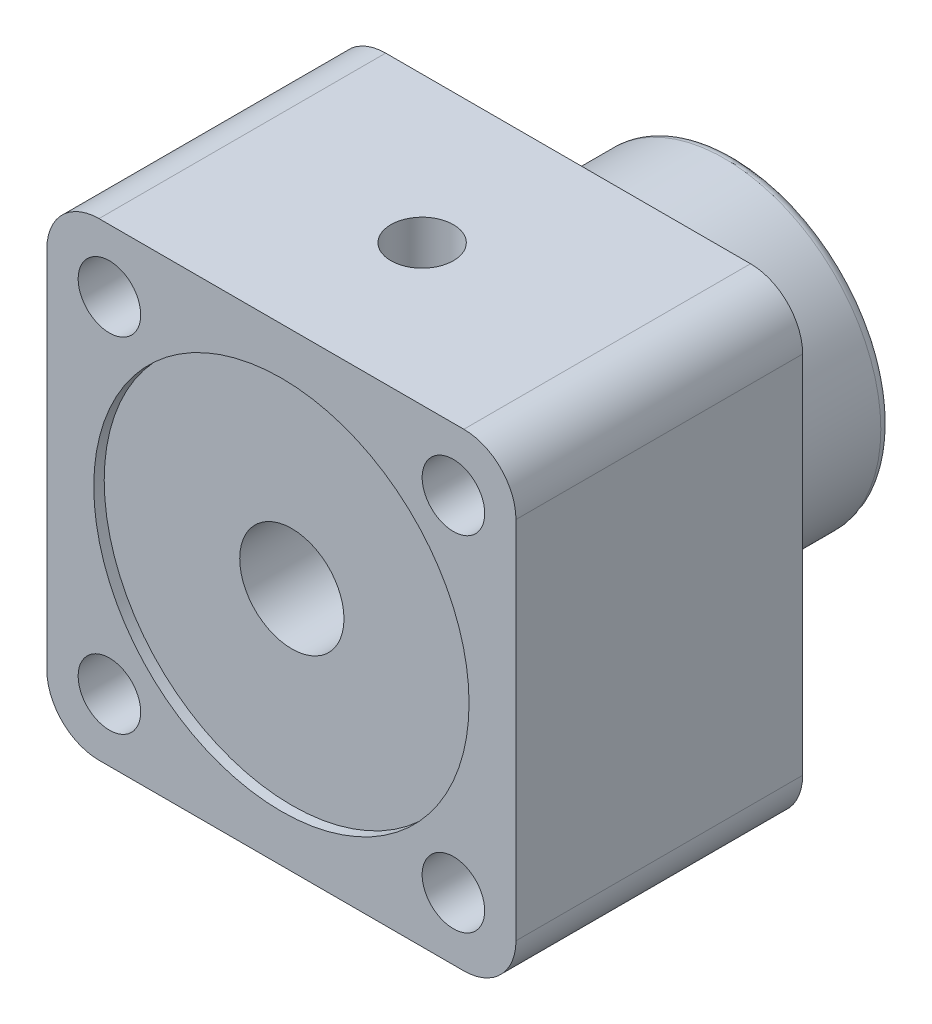
ISO-10303-21;
HEADER;
FILE_DESCRIPTION(('STEP AP214'),'2;1');
FILE_NAME('part.step','',(''),(''),'','','');
FILE_SCHEMA(('AUTOMOTIVE_DESIGN { 1 0 10303 214 1 1 1 1 }'));
ENDSEC;
DATA;
#1=APPLICATION_CONTEXT('core data for automotive mechanical design processes');
#2=APPLICATION_PROTOCOL_DEFINITION('international standard','automotive_design',2000,#1);
#3=PRODUCT_CONTEXT('',#1,'mechanical');
#4=PRODUCT('Part','Part','',(#3));
#5=PRODUCT_RELATED_PRODUCT_CATEGORY('part','',(#4));
#6=PRODUCT_DEFINITION_FORMATION('','',#4);
#7=PRODUCT_DEFINITION_CONTEXT('part definition',#1,'design');
#8=PRODUCT_DEFINITION('design','',#6,#7);
#9=PRODUCT_DEFINITION_SHAPE('','',#8);
#10=(LENGTH_UNIT() NAMED_UNIT(*) SI_UNIT(.MILLI.,.METRE.));
#11=(NAMED_UNIT(*) PLANE_ANGLE_UNIT() SI_UNIT($,.RADIAN.));
#12=(NAMED_UNIT(*) SI_UNIT($,.STERADIAN.) SOLID_ANGLE_UNIT());
#13=UNCERTAINTY_MEASURE_WITH_UNIT(LENGTH_MEASURE(1.E-05),#10,'distance_accuracy_value','');
#14=(GEOMETRIC_REPRESENTATION_CONTEXT(3) GLOBAL_UNCERTAINTY_ASSIGNED_CONTEXT((#13)) GLOBAL_UNIT_ASSIGNED_CONTEXT((#10,
#11,#12)) REPRESENTATION_CONTEXT('',''));
#15=CARTESIAN_POINT('',(0.,0.,0.));
#16=DIRECTION('',(0.,0.,1.));
#17=DIRECTION('',(1.,0.,0.));
#18=AXIS2_PLACEMENT_3D('',#15,#16,#17);
#19=CARTESIAN_POINT('',(-40.,40.,0.));
#20=DIRECTION('',(0.,0.,1.));
#21=DIRECTION('',(1.,0.,0.));
#22=AXIS2_PLACEMENT_3D('',#19,#20,#21);
#23=PLANE('',#22);
#24=CARTESIAN_POINT('',(-39.,39.,0.));
#25=DIRECTION('',(0.,0.,1.));
#26=DIRECTION('',(-1.,0.,0.));
#27=AXIS2_PLACEMENT_3D('',#24,#25,#26);
#28=CIRCLE('',#27,3.);
#29=CARTESIAN_POINT('',(-42.,39.,0.));
#30=VERTEX_POINT('',#29);
#31=EDGE_CURVE('E262',#30,#30,#28,.T.);
#32=ORIENTED_EDGE('',*,*,#31,.T.);
#33=EDGE_LOOP('',(#32));
#34=FACE_BOUND('',#33,.T.);
#35=CARTESIAN_POINT('',(-39.,6.00000000000001,0.));
#36=DIRECTION('',(0.,0.,1.));
#37=DIRECTION('',(-1.,0.,0.));
#38=AXIS2_PLACEMENT_3D('',#35,#36,#37);
#39=CIRCLE('',#38,3.);
#40=CARTESIAN_POINT('',(-42.,6.00000000000001,0.));
#41=VERTEX_POINT('',#40);
#42=EDGE_CURVE('E256',#41,#41,#39,.T.);
#43=ORIENTED_EDGE('',*,*,#42,.T.);
#44=EDGE_LOOP('',(#43));
#45=FACE_BOUND('',#44,.T.);
#46=CARTESIAN_POINT('',(-6.00000000000002,6.00000000000001,0.));
#47=DIRECTION('',(0.,0.,1.));
#48=DIRECTION('',(1.,0.,0.));
#49=AXIS2_PLACEMENT_3D('',#46,#47,#48);
#50=CIRCLE('',#49,3.);
#51=CARTESIAN_POINT('',(-3.00000000000001,6.00000000000001,0.));
#52=VERTEX_POINT('',#51);
#53=EDGE_CURVE('E250',#52,#52,#50,.T.);
#54=ORIENTED_EDGE('',*,*,#53,.T.);
#55=EDGE_LOOP('',(#54));
#56=FACE_BOUND('',#55,.T.);
#57=CARTESIAN_POINT('',(-6.00000000000001,39.,0.));
#58=DIRECTION('',(0.,0.,1.));
#59=DIRECTION('',(1.,0.,0.));
#60=AXIS2_PLACEMENT_3D('',#57,#58,#59);
#61=CIRCLE('',#60,3.);
#62=CARTESIAN_POINT('',(-3.00000000000001,39.,0.));
#63=VERTEX_POINT('',#62);
#64=EDGE_CURVE('E244',#63,#63,#61,.T.);
#65=ORIENTED_EDGE('',*,*,#64,.T.);
#66=EDGE_LOOP('',(#65));
#67=FACE_BOUND('',#66,.T.);
#68=CARTESIAN_POINT('',(-40.,40.,0.));
#69=DIRECTION('',(0.,0.,1.));
#70=DIRECTION('',(1.,0.,0.));
#71=AXIS2_PLACEMENT_3D('',#68,#69,#70);
#72=CIRCLE('',#71,5.);
#73=CARTESIAN_POINT('',(-40.,45.,0.));
#74=VERTEX_POINT('',#73);
#75=CARTESIAN_POINT('',(-45.,40.,0.));
#76=VERTEX_POINT('',#75);
#77=EDGE_CURVE('E131',#74,#76,#72,.T.);
#78=ORIENTED_EDGE('',*,*,#77,.F.);
#79=DIRECTION('',(-1.,0.,0.));
#80=VECTOR('',#79,1.);
#81=CARTESIAN_POINT('',(-5.,45.,0.));
#82=LINE('',#81,#80);
#83=CARTESIAN_POINT('',(-5.,45.,0.));
#84=VERTEX_POINT('',#83);
#85=EDGE_CURVE('E84',#84,#74,#82,.T.);
#86=ORIENTED_EDGE('',*,*,#85,.F.);
#87=CARTESIAN_POINT('',(-5.,40.,0.));
#88=DIRECTION('',(0.,0.,1.));
#89=DIRECTION('',(1.,0.,0.));
#90=AXIS2_PLACEMENT_3D('',#87,#88,#89);
#91=CIRCLE('',#90,5.);
#92=CARTESIAN_POINT('',(0.,40.,0.));
#93=VERTEX_POINT('',#92);
#94=EDGE_CURVE('E78',#93,#84,#91,.T.);
#95=ORIENTED_EDGE('',*,*,#94,.F.);
#96=DIRECTION('',(0.,1.,0.));
#97=VECTOR('',#96,1.);
#98=CARTESIAN_POINT('',(0.,40.,0.));
#99=LINE('',#98,#97);
#100=CARTESIAN_POINT('',(0.,5.,0.));
#101=VERTEX_POINT('',#100);
#102=EDGE_CURVE('E121',#101,#93,#99,.T.);
#103=ORIENTED_EDGE('',*,*,#102,.F.);
#104=CARTESIAN_POINT('',(-4.99999999999999,5.,0.));
#105=DIRECTION('',(0.,0.,1.));
#106=DIRECTION('',(1.,0.,0.));
#107=AXIS2_PLACEMENT_3D('',#104,#105,#106);
#108=CIRCLE('',#107,5.);
#109=CARTESIAN_POINT('',(-4.99999999999999,0.,0.));
#110=VERTEX_POINT('',#109);
#111=EDGE_CURVE('E141',#110,#101,#108,.T.);
#112=ORIENTED_EDGE('',*,*,#111,.F.);
#113=DIRECTION('',(1.,0.,0.));
#114=VECTOR('',#113,1.);
#115=CARTESIAN_POINT('',(-40.,0.,0.));
#116=LINE('',#115,#114);
#117=CARTESIAN_POINT('',(-40.,0.,0.));
#118=VERTEX_POINT('',#117);
#119=EDGE_CURVE('E139',#118,#110,#116,.T.);
#120=ORIENTED_EDGE('',*,*,#119,.F.);
#121=CARTESIAN_POINT('',(-40.,5.,0.));
#122=DIRECTION('',(0.,0.,1.));
#123=DIRECTION('',(1.,0.,0.));
#124=AXIS2_PLACEMENT_3D('',#121,#122,#123);
#125=CIRCLE('',#124,5.);
#126=CARTESIAN_POINT('',(-45.,5.,0.));
#127=VERTEX_POINT('',#126);
#128=EDGE_CURVE('E137',#127,#118,#125,.T.);
#129=ORIENTED_EDGE('',*,*,#128,.F.);
#130=DIRECTION('',(0.,-1.,0.));
#131=VECTOR('',#130,1.);
#132=CARTESIAN_POINT('',(-45.,40.,0.));
#133=LINE('',#132,#131);
#134=EDGE_CURVE('E134',#76,#127,#133,.T.);
#135=ORIENTED_EDGE('',*,*,#134,.F.);
#136=EDGE_LOOP('',(#78,#86,#95,#103,#112,#120,#129,#135));
#137=FACE_BOUND('',#136,.T.);
#138=CARTESIAN_POINT('',(-22.5,22.5,0.));
#139=DIRECTION('',(0.,0.,1.));
#140=DIRECTION('',(1.,0.,0.));
#141=AXIS2_PLACEMENT_3D('',#138,#139,#140);
#142=CIRCLE('',#141,15.);
#143=CARTESIAN_POINT('',(-7.5,22.5,0.));
#144=VERTEX_POINT('',#143);
#145=EDGE_CURVE('E161',#144,#144,#142,.F.);
#146=ORIENTED_EDGE('',*,*,#145,.F.);
#147=EDGE_LOOP('',(#146));
#148=FACE_BOUND('',#147,.T.);
#149=ADVANCED_FACE('F32',(#34,#45,#56,#67,#137,#148),#23,.F.);
#150=CARTESIAN_POINT('',(-40.,40.,27.5));
#151=DIRECTION('',(0.,0.,1.));
#152=DIRECTION('',(1.,0.,0.));
#153=AXIS2_PLACEMENT_3D('',#150,#151,#152);
#154=PLANE('',#153);
#155=CARTESIAN_POINT('',(-22.5,22.5,27.5));
#156=DIRECTION('',(0.,0.,1.));
#157=DIRECTION('',(1.,0.,0.));
#158=AXIS2_PLACEMENT_3D('',#155,#156,#157);
#159=CIRCLE('',#158,18.);
#160=CARTESIAN_POINT('',(-4.50000000000001,22.5,27.5));
#161=VERTEX_POINT('',#160);
#162=EDGE_CURVE('E165',#161,#161,#159,.T.);
#163=ORIENTED_EDGE('',*,*,#162,.F.);
#164=EDGE_LOOP('',(#163));
#165=FACE_BOUND('',#164,.T.);
#166=CARTESIAN_POINT('',(-39.,6.00000000000001,27.5));
#167=DIRECTION('',(0.,0.,1.));
#168=DIRECTION('',(-1.,0.,0.));
#169=AXIS2_PLACEMENT_3D('',#166,#167,#168);
#170=CIRCLE('',#169,3.);
#171=CARTESIAN_POINT('',(-42.,6.00000000000001,27.5));
#172=VERTEX_POINT('',#171);
#173=EDGE_CURVE('E253',#172,#172,#170,.T.);
#174=ORIENTED_EDGE('',*,*,#173,.F.);
#175=EDGE_LOOP('',(#174));
#176=FACE_BOUND('',#175,.T.);
#177=CARTESIAN_POINT('',(-6.00000000000001,39.,27.5));
#178=DIRECTION('',(0.,0.,1.));
#179=DIRECTION('',(1.,0.,0.));
#180=AXIS2_PLACEMENT_3D('',#177,#178,#179);
#181=CIRCLE('',#180,3.);
#182=CARTESIAN_POINT('',(-3.00000000000001,39.,27.5));
#183=VERTEX_POINT('',#182);
#184=EDGE_CURVE('E135',#183,#183,#181,.T.);
#185=ORIENTED_EDGE('',*,*,#184,.F.);
#186=EDGE_LOOP('',(#185));
#187=FACE_BOUND('',#186,.T.);
#188=CARTESIAN_POINT('',(-40.,40.,27.5));
#189=DIRECTION('',(0.,0.,1.));
#190=DIRECTION('',(1.,0.,0.));
#191=AXIS2_PLACEMENT_3D('',#188,#189,#190);
#192=CIRCLE('',#191,5.);
#193=CARTESIAN_POINT('',(-40.,45.,27.5));
#194=VERTEX_POINT('',#193);
#195=CARTESIAN_POINT('',(-45.,40.,27.5));
#196=VERTEX_POINT('',#195);
#197=EDGE_CURVE('E146',#194,#196,#192,.T.);
#198=ORIENTED_EDGE('',*,*,#197,.T.);
#199=DIRECTION('',(0.,-1.,0.));
#200=VECTOR('',#199,1.);
#201=CARTESIAN_POINT('',(-45.,40.,27.5));
#202=LINE('',#201,#200);
#203=CARTESIAN_POINT('',(-45.,5.,27.5));
#204=VERTEX_POINT('',#203);
#205=EDGE_CURVE('E93',#196,#204,#202,.T.);
#206=ORIENTED_EDGE('',*,*,#205,.T.);
#207=CARTESIAN_POINT('',(-40.,5.,27.5));
#208=DIRECTION('',(0.,0.,1.));
#209=DIRECTION('',(1.,0.,0.));
#210=AXIS2_PLACEMENT_3D('',#207,#208,#209);
#211=CIRCLE('',#210,5.);
#212=CARTESIAN_POINT('',(-40.,0.,27.5));
#213=VERTEX_POINT('',#212);
#214=EDGE_CURVE('E236',#204,#213,#211,.T.);
#215=ORIENTED_EDGE('',*,*,#214,.T.);
#216=DIRECTION('',(1.,0.,0.));
#217=VECTOR('',#216,1.);
#218=CARTESIAN_POINT('',(-40.,0.,27.5));
#219=LINE('',#218,#217);
#220=CARTESIAN_POINT('',(-4.99999999999999,0.,27.5));
#221=VERTEX_POINT('',#220);
#222=EDGE_CURVE('E238',#213,#221,#219,.T.);
#223=ORIENTED_EDGE('',*,*,#222,.T.);
#224=CARTESIAN_POINT('',(-4.99999999999999,5.,27.5));
#225=DIRECTION('',(0.,0.,1.));
#226=DIRECTION('',(1.,0.,0.));
#227=AXIS2_PLACEMENT_3D('',#224,#225,#226);
#228=CIRCLE('',#227,5.);
#229=CARTESIAN_POINT('',(0.,5.,27.5));
#230=VERTEX_POINT('',#229);
#231=EDGE_CURVE('E113',#221,#230,#228,.T.);
#232=ORIENTED_EDGE('',*,*,#231,.T.);
#233=DIRECTION('',(0.,1.,0.));
#234=VECTOR('',#233,1.);
#235=CARTESIAN_POINT('',(0.,40.,27.5));
#236=LINE('',#235,#234);
#237=CARTESIAN_POINT('',(0.,40.,27.5));
#238=VERTEX_POINT('',#237);
#239=EDGE_CURVE('E106',#230,#238,#236,.T.);
#240=ORIENTED_EDGE('',*,*,#239,.T.);
#241=CARTESIAN_POINT('',(-5.,40.,27.5));
#242=DIRECTION('',(0.,0.,1.));
#243=DIRECTION('',(1.,0.,0.));
#244=AXIS2_PLACEMENT_3D('',#241,#242,#243);
#245=CIRCLE('',#244,5.);
#246=CARTESIAN_POINT('',(-5.,45.,27.5));
#247=VERTEX_POINT('',#246);
#248=EDGE_CURVE('E111',#238,#247,#245,.T.);
#249=ORIENTED_EDGE('',*,*,#248,.T.);
#250=DIRECTION('',(-1.,0.,0.));
#251=VECTOR('',#250,1.);
#252=CARTESIAN_POINT('',(-5.,45.,27.5));
#253=LINE('',#252,#251);
#254=EDGE_CURVE('E49',#247,#194,#253,.T.);
#255=ORIENTED_EDGE('',*,*,#254,.T.);
#256=EDGE_LOOP('',(#198,#206,#215,#223,#232,#240,#249,#255));
#257=FACE_BOUND('',#256,.T.);
#258=CARTESIAN_POINT('',(-6.00000000000002,6.00000000000001,27.5));
#259=DIRECTION('',(0.,0.,1.));
#260=DIRECTION('',(1.,0.,0.));
#261=AXIS2_PLACEMENT_3D('',#258,#259,#260);
#262=CIRCLE('',#261,3.);
#263=CARTESIAN_POINT('',(-3.00000000000001,6.00000000000001,27.5));
#264=VERTEX_POINT('',#263);
#265=EDGE_CURVE('E247',#264,#264,#262,.T.);
#266=ORIENTED_EDGE('',*,*,#265,.F.);
#267=EDGE_LOOP('',(#266));
#268=FACE_BOUND('',#267,.T.);
#269=CARTESIAN_POINT('',(-39.,39.,27.5));
#270=DIRECTION('',(0.,0.,1.));
#271=DIRECTION('',(-1.,0.,0.));
#272=AXIS2_PLACEMENT_3D('',#269,#270,#271);
#273=CIRCLE('',#272,3.);
#274=CARTESIAN_POINT('',(-42.,39.,27.5));
#275=VERTEX_POINT('',#274);
#276=EDGE_CURVE('E259',#275,#275,#273,.T.);
#277=ORIENTED_EDGE('',*,*,#276,.F.);
#278=EDGE_LOOP('',(#277));
#279=FACE_BOUND('',#278,.T.);
#280=ADVANCED_FACE('F108',(#165,#176,#187,#257,#268,#279),#154,.T.);
#281=CARTESIAN_POINT('',(-40.,40.,27.5));
#282=DIRECTION('',(0.,0.,-1.));
#283=DIRECTION('',(-1.,0.,0.));
#284=AXIS2_PLACEMENT_3D('',#281,#282,#283);
#285=CYLINDRICAL_SURFACE('',#284,5.);
#286=ORIENTED_EDGE('',*,*,#77,.T.);
#287=DIRECTION('',(0.,0.,-1.));
#288=VECTOR('',#287,1.);
#289=CARTESIAN_POINT('',(-45.,40.,27.5));
#290=LINE('',#289,#288);
#291=EDGE_CURVE('E159',#196,#76,#290,.T.);
#292=ORIENTED_EDGE('',*,*,#291,.F.);
#293=ORIENTED_EDGE('',*,*,#197,.F.);
#294=DIRECTION('',(0.,0.,-1.));
#295=VECTOR('',#294,1.);
#296=CARTESIAN_POINT('',(-40.,45.,27.5));
#297=LINE('',#296,#295);
#298=EDGE_CURVE('E127',#194,#74,#297,.T.);
#299=ORIENTED_EDGE('',*,*,#298,.T.);
#300=EDGE_LOOP('',(#286,#292,#293,#299));
#301=FACE_BOUND('',#300,.T.);
#302=ADVANCED_FACE('F193',(#301),#285,.T.);
#303=CARTESIAN_POINT('',(-45.,40.,27.5));
#304=DIRECTION('',(1.,0.,0.));
#305=DIRECTION('',(0.,1.,0.));
#306=AXIS2_PLACEMENT_3D('',#303,#304,#305);
#307=PLANE('',#306);
#308=ORIENTED_EDGE('',*,*,#134,.T.);
#309=DIRECTION('',(0.,0.,-1.));
#310=VECTOR('',#309,1.);
#311=CARTESIAN_POINT('',(-45.,5.,27.5));
#312=LINE('',#311,#310);
#313=EDGE_CURVE('E156',#204,#127,#312,.T.);
#314=ORIENTED_EDGE('',*,*,#313,.F.);
#315=ORIENTED_EDGE('',*,*,#205,.F.);
#316=ORIENTED_EDGE('',*,*,#291,.T.);
#317=EDGE_LOOP('',(#308,#314,#315,#316));
#318=FACE_BOUND('',#317,.T.);
#319=ADVANCED_FACE('F220',(#318),#307,.F.);
#320=CARTESIAN_POINT('',(-40.,5.,27.5));
#321=DIRECTION('',(0.,0.,-1.));
#322=DIRECTION('',(-1.,0.,0.));
#323=AXIS2_PLACEMENT_3D('',#320,#321,#322);
#324=CYLINDRICAL_SURFACE('',#323,5.);
#325=ORIENTED_EDGE('',*,*,#128,.T.);
#326=DIRECTION('',(0.,0.,-1.));
#327=VECTOR('',#326,1.);
#328=CARTESIAN_POINT('',(-40.,0.,27.5));
#329=LINE('',#328,#327);
#330=EDGE_CURVE('E153',#213,#118,#329,.T.);
#331=ORIENTED_EDGE('',*,*,#330,.F.);
#332=ORIENTED_EDGE('',*,*,#214,.F.);
#333=ORIENTED_EDGE('',*,*,#313,.T.);
#334=EDGE_LOOP('',(#325,#331,#332,#333));
#335=FACE_BOUND('',#334,.T.);
#336=ADVANCED_FACE('F216',(#335),#324,.T.);
#337=CARTESIAN_POINT('',(-40.,0.,27.5));
#338=DIRECTION('',(0.,1.,0.));
#339=DIRECTION('',(0.,0.,1.));
#340=AXIS2_PLACEMENT_3D('',#337,#338,#339);
#341=PLANE('',#340);
#342=ORIENTED_EDGE('',*,*,#119,.T.);
#343=DIRECTION('',(0.,0.,-1.));
#344=VECTOR('',#343,1.);
#345=CARTESIAN_POINT('',(-4.99999999999999,0.,27.5));
#346=LINE('',#345,#344);
#347=EDGE_CURVE('E150',#221,#110,#346,.T.);
#348=ORIENTED_EDGE('',*,*,#347,.F.);
#349=ORIENTED_EDGE('',*,*,#222,.F.);
#350=ORIENTED_EDGE('',*,*,#330,.T.);
#351=EDGE_LOOP('',(#342,#348,#349,#350));
#352=FACE_BOUND('',#351,.T.);
#353=ADVANCED_FACE('F212',(#352),#341,.F.);
#354=CARTESIAN_POINT('',(-4.99999999999999,5.,27.5));
#355=DIRECTION('',(0.,0.,-1.));
#356=DIRECTION('',(-1.,0.,0.));
#357=AXIS2_PLACEMENT_3D('',#354,#355,#356);
#358=CYLINDRICAL_SURFACE('',#357,5.);
#359=ORIENTED_EDGE('',*,*,#111,.T.);
#360=DIRECTION('',(0.,0.,-1.));
#361=VECTOR('',#360,1.);
#362=CARTESIAN_POINT('',(0.,5.,27.5));
#363=LINE('',#362,#361);
#364=EDGE_CURVE('E122',#230,#101,#363,.T.);
#365=ORIENTED_EDGE('',*,*,#364,.F.);
#366=ORIENTED_EDGE('',*,*,#231,.F.);
#367=ORIENTED_EDGE('',*,*,#347,.T.);
#368=EDGE_LOOP('',(#359,#365,#366,#367));
#369=FACE_BOUND('',#368,.T.);
#370=ADVANCED_FACE('F209',(#369),#358,.T.);
#371=CARTESIAN_POINT('',(0.,40.,27.5));
#372=DIRECTION('',(-1.,0.,0.));
#373=DIRECTION('',(0.,-1.,0.));
#374=AXIS2_PLACEMENT_3D('',#371,#372,#373);
#375=PLANE('',#374);
#376=ORIENTED_EDGE('',*,*,#102,.T.);
#377=DIRECTION('',(0.,0.,-1.));
#378=VECTOR('',#377,1.);
#379=CARTESIAN_POINT('',(0.,40.,27.5));
#380=LINE('',#379,#378);
#381=EDGE_CURVE('E118',#238,#93,#380,.T.);
#382=ORIENTED_EDGE('',*,*,#381,.F.);
#383=ORIENTED_EDGE('',*,*,#239,.F.);
#384=ORIENTED_EDGE('',*,*,#364,.T.);
#385=EDGE_LOOP('',(#376,#382,#383,#384));
#386=FACE_BOUND('',#385,.T.);
#387=ADVANCED_FACE('F119',(#386),#375,.F.);
#388=CARTESIAN_POINT('',(-5.,40.,27.5));
#389=DIRECTION('',(0.,0.,-1.));
#390=DIRECTION('',(-1.,0.,0.));
#391=AXIS2_PLACEMENT_3D('',#388,#389,#390);
#392=CYLINDRICAL_SURFACE('',#391,5.);
#393=ORIENTED_EDGE('',*,*,#94,.T.);
#394=DIRECTION('',(0.,0.,-1.));
#395=VECTOR('',#394,1.);
#396=CARTESIAN_POINT('',(-5.,45.,27.5));
#397=LINE('',#396,#395);
#398=EDGE_CURVE('E123',#247,#84,#397,.T.);
#399=ORIENTED_EDGE('',*,*,#398,.F.);
#400=ORIENTED_EDGE('',*,*,#248,.F.);
#401=ORIENTED_EDGE('',*,*,#381,.T.);
#402=EDGE_LOOP('',(#393,#399,#400,#401));
#403=FACE_BOUND('',#402,.T.);
#404=ADVANCED_FACE('F125',(#403),#392,.T.);
#405=CARTESIAN_POINT('',(-5.,45.,27.5));
#406=DIRECTION('',(0.,-1.,0.));
#407=DIRECTION('',(1.,0.,0.));
#408=AXIS2_PLACEMENT_3D('',#405,#406,#407);
#409=PLANE('',#408);
#410=CARTESIAN_POINT('',(-22.5,45.,14.));
#411=DIRECTION('',(0.,1.,0.));
#412=DIRECTION('',(-1.,0.,0.));
#413=AXIS2_PLACEMENT_3D('',#410,#411,#412);
#414=CIRCLE('',#413,2.99999999999999);
#415=CARTESIAN_POINT('',(-25.5,45.,14.));
#416=VERTEX_POINT('',#415);
#417=EDGE_CURVE('E280',#416,#416,#414,.T.);
#418=ORIENTED_EDGE('',*,*,#417,.F.);
#419=EDGE_LOOP('',(#418));
#420=FACE_BOUND('',#419,.T.);
#421=ORIENTED_EDGE('',*,*,#85,.T.);
#422=ORIENTED_EDGE('',*,*,#298,.F.);
#423=ORIENTED_EDGE('',*,*,#254,.F.);
#424=ORIENTED_EDGE('',*,*,#398,.T.);
#425=EDGE_LOOP('',(#421,#422,#423,#424));
#426=FACE_BOUND('',#425,.T.);
#427=ADVANCED_FACE('F200',(#420,#426),#409,.F.);
#428=CARTESIAN_POINT('',(-6.00000000000001,39.,27.5));
#429=DIRECTION('',(0.,0.,-1.));
#430=DIRECTION('',(-1.,0.,0.));
#431=AXIS2_PLACEMENT_3D('',#428,#429,#430);
#432=CYLINDRICAL_SURFACE('',#431,3.);
#433=ORIENTED_EDGE('',*,*,#184,.T.);
#434=EDGE_LOOP('',(#433));
#435=FACE_BOUND('',#434,.T.);
#436=ORIENTED_EDGE('',*,*,#64,.F.);
#437=EDGE_LOOP('',(#436));
#438=FACE_BOUND('',#437,.T.);
#439=ADVANCED_FACE('F203',(#435,#438),#432,.F.);
#440=CARTESIAN_POINT('',(-6.00000000000002,6.00000000000001,27.5));
#441=DIRECTION('',(0.,0.,-1.));
#442=DIRECTION('',(-1.,0.,0.));
#443=AXIS2_PLACEMENT_3D('',#440,#441,#442);
#444=CYLINDRICAL_SURFACE('',#443,3.);
#445=ORIENTED_EDGE('',*,*,#265,.T.);
#446=EDGE_LOOP('',(#445));
#447=FACE_BOUND('',#446,.T.);
#448=ORIENTED_EDGE('',*,*,#53,.F.);
#449=EDGE_LOOP('',(#448));
#450=FACE_BOUND('',#449,.T.);
#451=ADVANCED_FACE('F305',(#447,#450),#444,.F.);
#452=CARTESIAN_POINT('',(-39.,6.00000000000001,27.5));
#453=DIRECTION('',(0.,0.,-1.));
#454=DIRECTION('',(-1.,0.,0.));
#455=AXIS2_PLACEMENT_3D('',#452,#453,#454);
#456=CYLINDRICAL_SURFACE('',#455,3.);
#457=ORIENTED_EDGE('',*,*,#173,.T.);
#458=EDGE_LOOP('',(#457));
#459=FACE_BOUND('',#458,.T.);
#460=ORIENTED_EDGE('',*,*,#42,.F.);
#461=EDGE_LOOP('',(#460));
#462=FACE_BOUND('',#461,.T.);
#463=ADVANCED_FACE('F301',(#459,#462),#456,.F.);
#464=CARTESIAN_POINT('',(-39.,39.,27.5));
#465=DIRECTION('',(0.,0.,-1.));
#466=DIRECTION('',(-1.,0.,0.));
#467=AXIS2_PLACEMENT_3D('',#464,#465,#466);
#468=CYLINDRICAL_SURFACE('',#467,3.);
#469=ORIENTED_EDGE('',*,*,#276,.T.);
#470=EDGE_LOOP('',(#469));
#471=FACE_BOUND('',#470,.T.);
#472=ORIENTED_EDGE('',*,*,#31,.F.);
#473=EDGE_LOOP('',(#472));
#474=FACE_BOUND('',#473,.T.);
#475=ADVANCED_FACE('F297',(#471,#474),#468,.F.);
#476=CARTESIAN_POINT('',(-22.5,22.5,26.5));
#477=DIRECTION('',(0.,0.,1.));
#478=DIRECTION('',(1.,0.,0.));
#479=AXIS2_PLACEMENT_3D('',#476,#477,#478);
#480=CYLINDRICAL_SURFACE('',#479,18.);
#481=CARTESIAN_POINT('',(-22.5,22.5,26.5));
#482=DIRECTION('',(0.,0.,1.));
#483=DIRECTION('',(1.,0.,0.));
#484=AXIS2_PLACEMENT_3D('',#481,#482,#483);
#485=CIRCLE('',#484,18.);
#486=CARTESIAN_POINT('',(-4.50000000000001,22.5,26.5));
#487=VERTEX_POINT('',#486);
#488=EDGE_CURVE('E264',#487,#487,#485,.T.);
#489=ORIENTED_EDGE('',*,*,#488,.F.);
#490=EDGE_LOOP('',(#489));
#491=FACE_BOUND('',#490,.T.);
#492=ORIENTED_EDGE('',*,*,#162,.T.);
#493=EDGE_LOOP('',(#492));
#494=FACE_BOUND('',#493,.T.);
#495=ADVANCED_FACE('F293',(#491,#494),#480,.F.);
#496=CARTESIAN_POINT('',(-22.5,22.5,26.5));
#497=DIRECTION('',(0.,0.,1.));
#498=DIRECTION('',(1.,0.,0.));
#499=AXIS2_PLACEMENT_3D('',#496,#497,#498);
#500=PLANE('',#499);
#501=CARTESIAN_POINT('',(-22.5,22.5,26.5));
#502=DIRECTION('',(0.,0.,1.));
#503=DIRECTION('',(1.,0.,0.));
#504=AXIS2_PLACEMENT_3D('',#501,#502,#503);
#505=CIRCLE('',#504,5.);
#506=CARTESIAN_POINT('',(-17.5,22.5,26.5));
#507=VERTEX_POINT('',#506);
#508=EDGE_CURVE('E162',#507,#507,#505,.T.);
#509=ORIENTED_EDGE('',*,*,#508,.F.);
#510=EDGE_LOOP('',(#509));
#511=FACE_BOUND('',#510,.T.);
#512=ORIENTED_EDGE('',*,*,#488,.T.);
#513=EDGE_LOOP('',(#512));
#514=FACE_BOUND('',#513,.T.);
#515=ADVANCED_FACE('F289',(#511,#514),#500,.T.);
#516=CARTESIAN_POINT('',(-22.5,22.5,27.5));
#517=DIRECTION('',(0.,0.,-1.));
#518=DIRECTION('',(-1.,0.,0.));
#519=AXIS2_PLACEMENT_3D('',#516,#517,#518);
#520=CYLINDRICAL_SURFACE('',#519,5.);
#521=CARTESIAN_POINT('',(-25.5,26.5,14.));
#522=CARTESIAN_POINT('',(-25.4999999059924,26.4999999709466,13.9245383896343));
#523=CARTESIAN_POINT('',(-25.497146600745,26.5021456077839,13.8490800481743));
#524=CARTESIAN_POINT('',(-25.4857960202383,26.5106190584126,13.6988164208441));
#525=CARTESIAN_POINT('',(-25.4772965825183,26.516948474581,13.6240113963193));
#526=CARTESIAN_POINT('',(-25.44350195877,26.5418598855431,13.4014575991999));
#527=CARTESIAN_POINT('',(-25.4099103679258,26.5663652336387,13.2555338369614));
#528=CARTESIAN_POINT('',(-25.3228688806433,26.6272446631328,12.973804706127));
#529=CARTESIAN_POINT('',(-25.2695623358124,26.6635328421273,12.8379345902784));
#530=CARTESIAN_POINT('',(-25.145058939393,26.7437185783116,12.577132828574));
#531=CARTESIAN_POINT('',(-25.0738567513836,26.7876184040559,12.4522044605218));
#532=CARTESIAN_POINT('',(-24.9054234193106,26.8845721143975,12.2000986897546));
#533=CARTESIAN_POINT('',(-24.8060741998395,26.9380889683227,12.0745139192543));
#534=CARTESIAN_POINT('',(-24.588545421592,27.0445230376381,11.8404746436311));
#535=CARTESIAN_POINT('',(-24.4703517509353,27.0974397715576,11.7320330985768));
#536=CARTESIAN_POINT('',(-24.2028457804227,27.2035179816543,11.5237175312858));
#537=CARTESIAN_POINT('',(-24.0515512930991,27.2560886962505,11.4260335863589));
#538=CARTESIAN_POINT('',(-23.8113243043916,27.3257056366947,11.300253491412));
#539=CARTESIAN_POINT('',(-23.729007367826,27.3473766136099,11.2617758845419));
#540=CARTESIAN_POINT('',(-23.5604722129963,27.3870100275605,11.1922090351209));
#541=CARTESIAN_POINT('',(-23.4742566189468,27.4049749151909,11.1611149082884));
#542=CARTESIAN_POINT('',(-23.3069680266714,27.4351119388654,11.1093725375467));
#543=CARTESIAN_POINT('',(-23.2261841587402,27.4476721644713,11.0880127284709));
#544=CARTESIAN_POINT('',(-23.0626663487444,27.4689232378774,11.052050038649));
#545=CARTESIAN_POINT('',(-22.9799335205276,27.4776162419249,11.0374433923624));
#546=CARTESIAN_POINT('',(-22.8132446212674,27.4908775487531,11.0152153154839));
#547=CARTESIAN_POINT('',(-22.7292892272654,27.4954480523918,11.0075901576882));
#548=CARTESIAN_POINT('',(-22.5609397888852,27.5003394160743,10.9994333601528));
#549=CARTESIAN_POINT('',(-22.4765457900102,27.5006607084841,10.9989009987064));
#550=CARTESIAN_POINT('',(-22.2448288163536,27.4956527008736,11.0072427822798));
#551=CARTESIAN_POINT('',(-22.0977800427328,27.4859047961414,11.0234711496492));
#552=CARTESIAN_POINT('',(-21.8090437511816,27.4541639055029,11.0769554936824));
#553=CARTESIAN_POINT('',(-21.6673566308687,27.4321700133334,11.1142130266105));
#554=CARTESIAN_POINT('',(-21.3918939293081,27.3776970751198,11.208332233002));
#555=CARTESIAN_POINT('',(-21.2581690327734,27.3451579214078,11.2653064201999));
#556=CARTESIAN_POINT('',(-21.0020206643965,27.2721930404585,11.3967689344517));
#557=CARTESIAN_POINT('',(-20.8796001391876,27.2317652654494,11.4712618101359));
#558=CARTESIAN_POINT('',(-20.6338521020075,27.1407584283917,11.6456782796185));
#559=CARTESIAN_POINT('',(-20.5121628451924,27.089543633238,11.7475766485355));
#560=CARTESIAN_POINT('',(-20.2865705107683,26.9851111079678,11.9688082101049));
#561=CARTESIAN_POINT('',(-20.1826919256589,26.9318907405416,12.0881649997191));
#562=CARTESIAN_POINT('',(-19.9835032984068,26.8222214952534,12.3573068203978));
#563=CARTESIAN_POINT('',(-19.8905813507241,26.7661132258375,12.5090151553296));
#564=CARTESIAN_POINT('',(-19.7320556416455,26.6650175930069,12.8294124610267));
#565=CARTESIAN_POINT('',(-19.6664015564863,26.620009806217,12.9980694313142));
#566=CARTESIAN_POINT('',(-19.5784500619157,26.5579173037536,13.3047872644956));
#567=CARTESIAN_POINT('',(-19.5494419368152,26.5366777727856,13.4400812657923));
#568=CARTESIAN_POINT('',(-19.5103825418295,26.5078430151324,13.7147472194013));
#569=CARTESIAN_POINT('',(-19.5003092248945,26.5002319204476,13.8541142368845));
#570=CARTESIAN_POINT('',(-19.4997043867762,26.4997782882838,14.1331033689616));
#571=CARTESIAN_POINT('',(-19.5091999392381,26.5069562114942,14.2727255696017));
#572=CARTESIAN_POINT('',(-19.5471941552837,26.535030408753,14.5479746723138));
#573=CARTESIAN_POINT('',(-19.5757078395489,26.5559375260331,14.6835983278199));
#574=CARTESIAN_POINT('',(-19.6502338713207,26.6086353928605,14.9474292155495));
#575=CARTESIAN_POINT('',(-19.6962243561851,26.6404125395823,15.0756454841376));
#576=CARTESIAN_POINT('',(-19.804074317352,26.7114306905888,15.3229552203075));
#577=CARTESIAN_POINT('',(-19.8659397796483,26.7506745088925,15.4420452245939));
#578=CARTESIAN_POINT('',(-20.0166532419614,26.840736814247,15.6904810952463));
#579=CARTESIAN_POINT('',(-20.108354961473,26.8923665298154,15.8178054323294));
#580=CARTESIAN_POINT('',(-20.3102438590411,26.9964333525296,16.0565672039454));
#581=CARTESIAN_POINT('',(-20.4204487254287,27.0488711882261,16.1679892460944));
#582=CARTESIAN_POINT('',(-20.6734852447168,27.1567199153866,16.3864639913158));
#583=CARTESIAN_POINT('',(-20.8186960297997,27.2116308034312,16.4910647057629));
#584=CARTESIAN_POINT('',(-21.0505536872149,27.2859945820211,16.6281544977234));
#585=CARTESIAN_POINT('',(-21.1302139428835,27.3094564067687,16.6705620021369));
#586=CARTESIAN_POINT('',(-21.2937634383768,27.3530540068653,16.7483038834785));
#587=CARTESIAN_POINT('',(-21.3776499740143,27.3731918746406,16.7836427131187));
#588=CARTESIAN_POINT('',(-21.5428593012251,27.4082066725368,16.8444796432344));
#589=CARTESIAN_POINT('',(-21.623930532662,27.4233583127873,16.8705037184618));
#590=CARTESIAN_POINT('',(-21.7885393800187,27.4498249745913,16.9156649816091));
#591=CARTESIAN_POINT('',(-21.8720755852912,27.4611421459459,16.9348060288799));
#592=CARTESIAN_POINT('',(-22.0408803849177,27.4795990393125,16.9659003097131));
#593=CARTESIAN_POINT('',(-22.126147758696,27.4867416056036,16.9778584373605));
#594=CARTESIAN_POINT('',(-22.2976158408365,27.496642169756,16.994406761659));
#595=CARTESIAN_POINT('',(-22.3838164260546,27.4994007391863,16.9989979187889));
#596=CARTESIAN_POINT('',(-22.6195193840806,27.5007935360193,17.0013282897594));
#597=CARTESIAN_POINT('',(-22.7692131349716,27.4949361975757,16.9916010745741));
#598=CARTESIAN_POINT('',(-23.0643255444776,27.4702639144478,16.9502179458511));
#599=CARTESIAN_POINT('',(-23.2097441554555,27.451448825435,16.9185617880599));
#600=CARTESIAN_POINT('',(-23.4902836174303,27.4029872602298,16.8355594293537));
#601=CARTESIAN_POINT('',(-23.6255320564868,27.373519006359,16.784536560451));
#602=CARTESIAN_POINT('',(-23.8855659531815,27.3060670798365,16.6647190582365));
#603=CARTESIAN_POINT('',(-24.010349056203,27.2680814978788,16.5959204396564));
#604=CARTESIAN_POINT('',(-24.2605265281201,27.1818686167897,16.4341500931042));
#605=CARTESIAN_POINT('',(-24.384516634541,27.1329771459258,16.3393649364719));
#606=CARTESIAN_POINT('',(-24.6157957778969,27.0320378935883,16.1324915754345));
#607=CARTESIAN_POINT('',(-24.7230660453146,26.9799866547464,16.0203842023356));
#608=CARTESIAN_POINT('',(-24.9318169985264,26.8705644973161,15.7654389566212));
#609=CARTESIAN_POINT('',(-25.0308384117981,26.8133560399019,15.6205069155109));
#610=CARTESIAN_POINT('',(-25.2031460606112,26.707524577675,15.3129904274047));
#611=CARTESIAN_POINT('',(-25.2764456760767,26.6588971157777,15.150415215802));
#612=CARTESIAN_POINT('',(-25.3619348491458,26.6000473046376,14.9033774473124));
#613=CARTESIAN_POINT('',(-25.3857123661333,26.5832950867822,14.8243414087028));
#614=CARTESIAN_POINT('',(-25.4267938174555,26.5539508765597,14.6638695581998));
#615=CARTESIAN_POINT('',(-25.4441018477236,26.5413562525471,14.5824353000127));
#616=CARTESIAN_POINT('',(-25.4719122127143,26.5209497222627,14.4179534493059));
#617=CARTESIAN_POINT('',(-25.4824253383151,26.5131302337705,14.3349086316283));
#618=CARTESIAN_POINT('',(-25.4964688448544,26.5026557137783,14.1679077833364));
#619=CARTESIAN_POINT('',(-25.5000001045845,26.5000000323223,14.0839518687376));
#620=CARTESIAN_POINT('',(-25.5,26.5,14.));
#621=B_SPLINE_CURVE_WITH_KNOTS('',3,(#521,#522,#523,#524,#525,#526,#527,#528,#529,#530,#531,
#532,#533,#534,#535,#536,#537,#538,#539,#540,#541,#542,#543,#544,#545,#546,#547,#548,#549,#550,
#551,#552,#553,#554,#555,#556,#557,#558,#559,#560,#561,#562,#563,#564,#565,#566,#567,#568,#569,
#570,#571,#572,#573,#574,#575,#576,#577,#578,#579,#580,#581,#582,#583,#584,#585,#586,#587,#588,
#589,#590,#591,#592,#593,#594,#595,#596,#597,#598,#599,#600,#601,#602,#603,#604,#605,#606,#607,
#608,#609,#610,#611,#612,#613,#614,#615,#616,#617,#618,#619,#620),.UNSPECIFIED.,.T.,.F.,(4,2,2,
2,2,2,2,2,2,2,2,2,2,2,2,2,2,2,2,2,2,2,2,2,2,2,2,2,2,2,2,2,2,2,2,2,2,2,2,2,2,2,2,2,2,2,2,2,2,4),
(0.,0.226288173517877,0.452663065091106,0.905305714765853,1.35471981612576,1.804268090599,
2.30878181396805,2.81367513819685,3.37309572088443,3.6529763439831,3.93267130287329,
4.18580566749443,4.43879871451845,4.69165661737849,4.94448879122708,5.38694235003538,
5.82942865693064,6.27448283989928,6.71965270654931,7.21799594026828,7.71701907227942,
8.27387316194677,8.82969494223661,9.24786570023492,9.66554925202077,10.0838110593649,
10.5024036052238,10.9204742264511,11.3387027222345,11.8323285087813,12.3264288987103,
12.884776299373,13.1641700331408,13.4433872125907,13.7024631857776,13.9613936663242,
14.2201475237758,14.4788676430946,14.9267946196281,15.3747265854331,15.8154875864152,
16.2563474905318,16.7450674536299,17.2343321574792,17.7856420979722,18.3366648323362,
18.5890061072371,18.8411873492278,19.0929671157917,19.3447151893881),.UNSPECIFIED.);
#622=CARTESIAN_POINT('',(-25.5,26.5,14.));
#623=VERTEX_POINT('',#622);
#624=EDGE_CURVE('E273',#623,#623,#621,.T.);
#625=ORIENTED_EDGE('',*,*,#624,.F.);
#626=EDGE_LOOP('',(#625));
#627=FACE_BOUND('',#626,.T.);
#628=ORIENTED_EDGE('',*,*,#508,.T.);
#629=EDGE_LOOP('',(#628));
#630=FACE_BOUND('',#629,.T.);
#631=CARTESIAN_POINT('',(-22.5,22.5,-16.));
#632=DIRECTION('',(0.,0.,-1.));
#633=DIRECTION('',(-1.,0.,0.));
#634=AXIS2_PLACEMENT_3D('',#631,#632,#633);
#635=CIRCLE('',#634,5.);
#636=CARTESIAN_POINT('',(-27.5,22.5,-16.));
#637=VERTEX_POINT('',#636);
#638=EDGE_CURVE('E166',#637,#637,#635,.T.);
#639=ORIENTED_EDGE('',*,*,#638,.T.);
#640=EDGE_LOOP('',(#639));
#641=FACE_BOUND('',#640,.T.);
#642=ADVANCED_FACE('F285',(#627,#630,#641),#520,.F.);
#643=CARTESIAN_POINT('',(-22.5,22.5,-16.));
#644=DIRECTION('',(0.,0.,-1.));
#645=DIRECTION('',(-1.,0.,0.));
#646=AXIS2_PLACEMENT_3D('',#643,#644,#645);
#647=PLANE('',#646);
#648=CARTESIAN_POINT('',(-22.5,22.5,-16.));
#649=DIRECTION('',(0.,0.,-1.));
#650=DIRECTION('',(-1.,0.,0.));
#651=AXIS2_PLACEMENT_3D('',#648,#649,#650);
#652=CIRCLE('',#651,14.);
#653=CARTESIAN_POINT('',(-36.5,22.5,-16.));
#654=VERTEX_POINT('',#653);
#655=EDGE_CURVE('E41',#654,#654,#652,.T.);
#656=ORIENTED_EDGE('',*,*,#655,.T.);
#657=EDGE_LOOP('',(#656));
#658=FACE_BOUND('',#657,.T.);
#659=ORIENTED_EDGE('',*,*,#638,.F.);
#660=EDGE_LOOP('',(#659));
#661=FACE_BOUND('',#660,.T.);
#662=ADVANCED_FACE('F171',(#658,#661),#647,.T.);
#663=CARTESIAN_POINT('',(-22.5,22.5,-16.));
#664=DIRECTION('',(0.,0.,1.));
#665=DIRECTION('',(1.,0.,0.));
#666=AXIS2_PLACEMENT_3D('',#663,#664,#665);
#667=CYLINDRICAL_SURFACE('',#666,15.);
#668=CARTESIAN_POINT('',(-22.5,22.5,-15.));
#669=DIRECTION('',(0.,0.,-1.));
#670=DIRECTION('',(-1.,0.,0.));
#671=AXIS2_PLACEMENT_3D('',#668,#669,#670);
#672=CIRCLE('',#671,15.);
#673=CARTESIAN_POINT('',(-37.5,22.5,-15.));
#674=VERTEX_POINT('',#673);
#675=EDGE_CURVE('E11',#674,#674,#672,.F.);
#676=ORIENTED_EDGE('',*,*,#675,.T.);
#677=EDGE_LOOP('',(#676));
#678=FACE_BOUND('',#677,.T.);
#679=ORIENTED_EDGE('',*,*,#145,.T.);
#680=EDGE_LOOP('',(#679));
#681=FACE_BOUND('',#680,.T.);
#682=ADVANCED_FACE('F176',(#678,#681),#667,.T.);
#683=CARTESIAN_POINT('',(-22.5,22.5,-15.));
#684=DIRECTION('',(0.,0.,-1.));
#685=DIRECTION('',(-1.,0.,0.));
#686=AXIS2_PLACEMENT_3D('',#683,#684,#685);
#687=TOROIDAL_SURFACE('',#686,14.,1.);
#688=ORIENTED_EDGE('',*,*,#675,.F.);
#689=EDGE_LOOP('',(#688));
#690=FACE_BOUND('',#689,.T.);
#691=ORIENTED_EDGE('',*,*,#655,.F.);
#692=EDGE_LOOP('',(#691));
#693=FACE_BOUND('',#692,.T.);
#694=ADVANCED_FACE('F34',(#690,#693),#687,.T.);
#695=CARTESIAN_POINT('',(-22.5,-0.00100000000000794,14.));
#696=DIRECTION('',(0.,1.,0.));
#697=DIRECTION('',(-1.,0.,0.));
#698=AXIS2_PLACEMENT_3D('',#695,#696,#697);
#699=CYLINDRICAL_SURFACE('',#698,2.99999999999999);
#700=ORIENTED_EDGE('',*,*,#624,.T.);
#701=EDGE_LOOP('',(#700));
#702=FACE_BOUND('',#701,.T.);
#703=ORIENTED_EDGE('',*,*,#417,.T.);
#704=EDGE_LOOP('',(#703));
#705=FACE_BOUND('',#704,.T.);
#706=ADVANCED_FACE('F175',(#702,#705),#699,.F.);
#707=CLOSED_SHELL('',(#149,#280,#302,#319,#336,#353,#370,#387,#404,#427,#439,#451,#463,#475,
#495,#515,#642,#662,#682,#694,#706));
#708=MANIFOLD_SOLID_BREP('B2',#707);
#709=ADVANCED_BREP_SHAPE_REPRESENTATION('',(#18,#708),#14);
#710=SHAPE_DEFINITION_REPRESENTATION(#9,#709);
ENDSEC;
END-ISO-10303-21;
